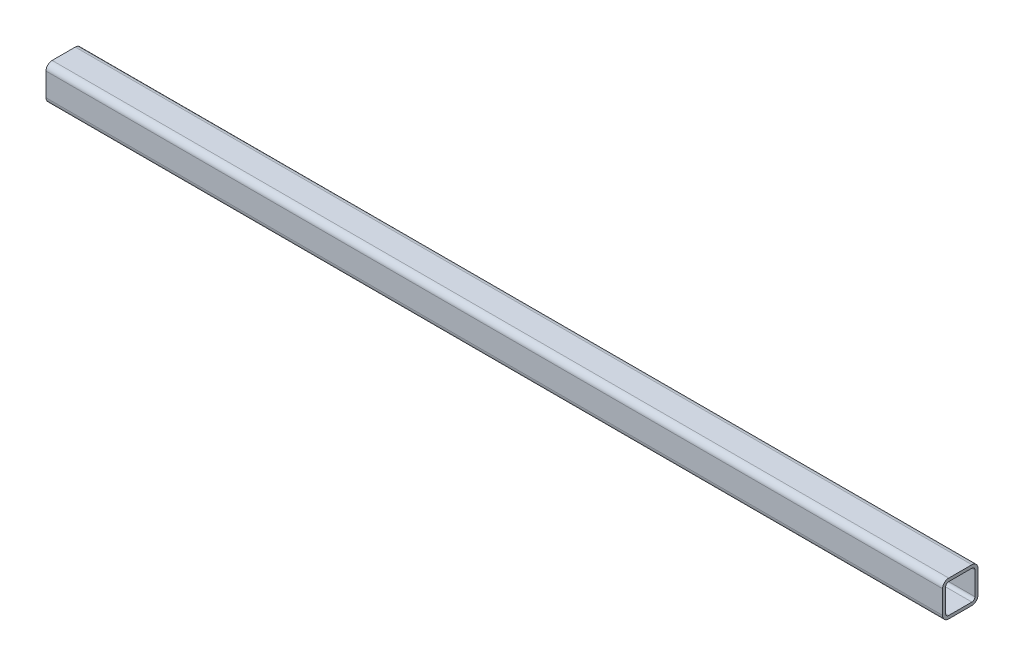
ISO-10303-21;
HEADER;
FILE_DESCRIPTION(('STEP AP214'),'2;1');
FILE_NAME('part.step','',(''),(''),'','','');
FILE_SCHEMA(('AUTOMOTIVE_DESIGN { 1 0 10303 214 1 1 1 1 }'));
ENDSEC;
DATA;
#1=APPLICATION_CONTEXT('core data for automotive mechanical design processes');
#2=APPLICATION_PROTOCOL_DEFINITION('international standard','automotive_design',2000,#1);
#3=PRODUCT_CONTEXT('',#1,'mechanical');
#4=PRODUCT('Part','Part','',(#3));
#5=PRODUCT_RELATED_PRODUCT_CATEGORY('part','',(#4));
#6=PRODUCT_DEFINITION_FORMATION('','',#4);
#7=PRODUCT_DEFINITION_CONTEXT('part definition',#1,'design');
#8=PRODUCT_DEFINITION('design','',#6,#7);
#9=PRODUCT_DEFINITION_SHAPE('','',#8);
#10=(LENGTH_UNIT() NAMED_UNIT(*) SI_UNIT(.MILLI.,.METRE.));
#11=(NAMED_UNIT(*) PLANE_ANGLE_UNIT() SI_UNIT($,.RADIAN.));
#12=(NAMED_UNIT(*) SI_UNIT($,.STERADIAN.) SOLID_ANGLE_UNIT());
#13=UNCERTAINTY_MEASURE_WITH_UNIT(LENGTH_MEASURE(1.E-05),#10,'distance_accuracy_value','');
#14=(GEOMETRIC_REPRESENTATION_CONTEXT(3) GLOBAL_UNCERTAINTY_ASSIGNED_CONTEXT((#13)) GLOBAL_UNIT_ASSIGNED_CONTEXT((#10,
#11,#12)) REPRESENTATION_CONTEXT('',''));
#15=CARTESIAN_POINT('',(0.,0.,0.));
#16=DIRECTION('',(0.,0.,1.));
#17=DIRECTION('',(1.,0.,0.));
#18=AXIS2_PLACEMENT_3D('',#15,#16,#17);
#19=CARTESIAN_POINT('',(380.,9.79999999999997,9.79999999999994));
#20=DIRECTION('',(-1.,0.,0.));
#21=DIRECTION('',(0.,0.,1.));
#22=AXIS2_PLACEMENT_3D('',#19,#20,#21);
#23=CYLINDRICAL_SURFACE('',#22,5.2);
#24=CARTESIAN_POINT('',(-380.,9.79999999999997,9.80000000000004));
#25=DIRECTION('',(1.,0.,0.));
#26=DIRECTION('',(0.,0.,-1.));
#27=AXIS2_PLACEMENT_3D('',#24,#25,#26);
#28=CIRCLE('',#27,5.2);
#29=CARTESIAN_POINT('',(-380.,15.,9.80000000000005));
#30=VERTEX_POINT('',#29);
#31=CARTESIAN_POINT('',(-380.,9.79999999999995,15.));
#32=VERTEX_POINT('',#31);
#33=EDGE_CURVE('E238',#30,#32,#28,.T.);
#34=ORIENTED_EDGE('',*,*,#33,.T.);
#35=DIRECTION('',(-1.,0.,0.));
#36=VECTOR('',#35,1.);
#37=CARTESIAN_POINT('',(380.,9.79999999999995,14.9999999999999));
#38=LINE('',#37,#36);
#39=CARTESIAN_POINT('',(380.,9.79999999999995,14.9999999999999));
#40=VERTEX_POINT('',#39);
#41=EDGE_CURVE('E12',#40,#32,#38,.T.);
#42=ORIENTED_EDGE('',*,*,#41,.F.);
#43=CARTESIAN_POINT('',(380.,9.79999999999997,9.79999999999994));
#44=DIRECTION('',(1.,0.,0.));
#45=DIRECTION('',(0.,0.,-1.));
#46=AXIS2_PLACEMENT_3D('',#43,#44,#45);
#47=CIRCLE('',#46,5.2);
#48=CARTESIAN_POINT('',(380.,15.,9.79999999999996));
#49=VERTEX_POINT('',#48);
#50=EDGE_CURVE('E316',#49,#40,#47,.T.);
#51=ORIENTED_EDGE('',*,*,#50,.F.);
#52=DIRECTION('',(-1.,0.,0.));
#53=VECTOR('',#52,1.);
#54=CARTESIAN_POINT('',(380.,15.,9.79999999999996));
#55=LINE('',#54,#53);
#56=EDGE_CURVE('E253',#49,#30,#55,.T.);
#57=ORIENTED_EDGE('',*,*,#56,.T.);
#58=EDGE_LOOP('',(#34,#42,#51,#57));
#59=FACE_BOUND('',#58,.T.);
#60=ADVANCED_FACE('F66',(#59),#23,.T.);
#61=CARTESIAN_POINT('',(380.,9.79999999999995,14.9999999999999));
#62=DIRECTION('',(0.,0.,-1.));
#63=DIRECTION('',(0.,1.,0.));
#64=AXIS2_PLACEMENT_3D('',#61,#62,#63);
#65=PLANE('',#64);
#66=DIRECTION('',(0.,-1.,0.));
#67=VECTOR('',#66,1.);
#68=CARTESIAN_POINT('',(-380.,9.79999999999995,15.));
#69=LINE('',#68,#67);
#70=CARTESIAN_POINT('',(-380.,-9.80000000000006,15.));
#71=VERTEX_POINT('',#70);
#72=EDGE_CURVE('E241',#32,#71,#69,.T.);
#73=ORIENTED_EDGE('',*,*,#72,.T.);
#74=DIRECTION('',(-1.,0.,0.));
#75=VECTOR('',#74,1.);
#76=CARTESIAN_POINT('',(380.,-9.80000000000006,14.9999999999999));
#77=LINE('',#76,#75);
#78=CARTESIAN_POINT('',(380.,-9.80000000000006,14.9999999999999));
#79=VERTEX_POINT('',#78);
#80=EDGE_CURVE('E76',#79,#71,#77,.T.);
#81=ORIENTED_EDGE('',*,*,#80,.F.);
#82=DIRECTION('',(0.,-1.,0.));
#83=VECTOR('',#82,1.);
#84=CARTESIAN_POINT('',(380.,9.79999999999995,14.9999999999999));
#85=LINE('',#84,#83);
#86=EDGE_CURVE('E318',#40,#79,#85,.T.);
#87=ORIENTED_EDGE('',*,*,#86,.F.);
#88=ORIENTED_EDGE('',*,*,#41,.T.);
#89=EDGE_LOOP('',(#73,#81,#87,#88));
#90=FACE_BOUND('',#89,.T.);
#91=ADVANCED_FACE('F353',(#90),#65,.F.);
#92=CARTESIAN_POINT('',(380.,-9.80000000000004,9.79999999999987));
#93=DIRECTION('',(-1.,0.,0.));
#94=DIRECTION('',(0.,0.,1.));
#95=AXIS2_PLACEMENT_3D('',#92,#93,#94);
#96=CYLINDRICAL_SURFACE('',#95,5.2);
#97=CARTESIAN_POINT('',(-380.,-9.80000000000004,9.79999999999997));
#98=DIRECTION('',(1.,0.,0.));
#99=DIRECTION('',(0.,0.,-1.));
#100=AXIS2_PLACEMENT_3D('',#97,#98,#99);
#101=CIRCLE('',#100,5.2);
#102=CARTESIAN_POINT('',(-380.,-15.,9.79999999999995));
#103=VERTEX_POINT('',#102);
#104=EDGE_CURVE('E243',#71,#103,#101,.T.);
#105=ORIENTED_EDGE('',*,*,#104,.T.);
#106=DIRECTION('',(-1.,0.,0.));
#107=VECTOR('',#106,1.);
#108=CARTESIAN_POINT('',(380.,-15.,9.79999999999985));
#109=LINE('',#108,#107);
#110=CARTESIAN_POINT('',(380.,-15.,9.79999999999985));
#111=VERTEX_POINT('',#110);
#112=EDGE_CURVE('E260',#111,#103,#109,.T.);
#113=ORIENTED_EDGE('',*,*,#112,.F.);
#114=CARTESIAN_POINT('',(380.,-9.80000000000004,9.79999999999987));
#115=DIRECTION('',(1.,0.,0.));
#116=DIRECTION('',(0.,0.,-1.));
#117=AXIS2_PLACEMENT_3D('',#114,#115,#116);
#118=CIRCLE('',#117,5.2);
#119=EDGE_CURVE('E320',#79,#111,#118,.T.);
#120=ORIENTED_EDGE('',*,*,#119,.F.);
#121=ORIENTED_EDGE('',*,*,#80,.T.);
#122=EDGE_LOOP('',(#105,#113,#120,#121));
#123=FACE_BOUND('',#122,.T.);
#124=ADVANCED_FACE('F358',(#123),#96,.T.);
#125=CARTESIAN_POINT('',(380.,-15.,-9.80000000000014));
#126=DIRECTION('',(0.,1.,0.));
#127=DIRECTION('',(0.,0.,1.));
#128=AXIS2_PLACEMENT_3D('',#125,#126,#127);
#129=PLANE('',#128);
#130=DIRECTION('',(0.,0.,-1.));
#131=VECTOR('',#130,1.);
#132=CARTESIAN_POINT('',(-380.,-15.,-9.80000000000005));
#133=LINE('',#132,#131);
#134=CARTESIAN_POINT('',(-380.,-15.,-9.80000000000005));
#135=VERTEX_POINT('',#134);
#136=EDGE_CURVE('E245',#103,#135,#133,.T.);
#137=ORIENTED_EDGE('',*,*,#136,.T.);
#138=DIRECTION('',(-1.,0.,0.));
#139=VECTOR('',#138,1.);
#140=CARTESIAN_POINT('',(380.,-15.,-9.80000000000014));
#141=LINE('',#140,#139);
#142=CARTESIAN_POINT('',(380.,-15.,-9.80000000000014));
#143=VERTEX_POINT('',#142);
#144=EDGE_CURVE('E257',#143,#135,#141,.T.);
#145=ORIENTED_EDGE('',*,*,#144,.F.);
#146=DIRECTION('',(0.,0.,-1.));
#147=VECTOR('',#146,1.);
#148=CARTESIAN_POINT('',(380.,-15.,-9.80000000000014));
#149=LINE('',#148,#147);
#150=EDGE_CURVE('E322',#111,#143,#149,.T.);
#151=ORIENTED_EDGE('',*,*,#150,.F.);
#152=ORIENTED_EDGE('',*,*,#112,.T.);
#153=EDGE_LOOP('',(#137,#145,#151,#152));
#154=FACE_BOUND('',#153,.T.);
#155=ADVANCED_FACE('F328',(#154),#129,.F.);
#156=CARTESIAN_POINT('',(380.,-9.79999999999997,-9.80000000000013));
#157=DIRECTION('',(-1.,0.,0.));
#158=DIRECTION('',(0.,0.,1.));
#159=AXIS2_PLACEMENT_3D('',#156,#157,#158);
#160=CYLINDRICAL_SURFACE('',#159,5.2);
#161=CARTESIAN_POINT('',(-380.,-9.79999999999997,-9.80000000000004));
#162=DIRECTION('',(1.,0.,0.));
#163=DIRECTION('',(0.,0.,-1.));
#164=AXIS2_PLACEMENT_3D('',#161,#162,#163);
#165=CIRCLE('',#164,5.2);
#166=CARTESIAN_POINT('',(-380.,-9.79999999999995,-15.));
#167=VERTEX_POINT('',#166);
#168=EDGE_CURVE('E247',#135,#167,#165,.T.);
#169=ORIENTED_EDGE('',*,*,#168,.T.);
#170=DIRECTION('',(-1.,0.,0.));
#171=VECTOR('',#170,1.);
#172=CARTESIAN_POINT('',(380.,-9.79999999999995,-15.0000000000001));
#173=LINE('',#172,#171);
#174=CARTESIAN_POINT('',(380.,-9.79999999999995,-15.0000000000001));
#175=VERTEX_POINT('',#174);
#176=EDGE_CURVE('E205',#175,#167,#173,.T.);
#177=ORIENTED_EDGE('',*,*,#176,.F.);
#178=CARTESIAN_POINT('',(380.,-9.79999999999997,-9.80000000000013));
#179=DIRECTION('',(1.,0.,0.));
#180=DIRECTION('',(0.,0.,-1.));
#181=AXIS2_PLACEMENT_3D('',#178,#179,#180);
#182=CIRCLE('',#181,5.2);
#183=EDGE_CURVE('E196',#143,#175,#182,.T.);
#184=ORIENTED_EDGE('',*,*,#183,.F.);
#185=ORIENTED_EDGE('',*,*,#144,.T.);
#186=EDGE_LOOP('',(#169,#177,#184,#185));
#187=FACE_BOUND('',#186,.T.);
#188=ADVANCED_FACE('F332',(#187),#160,.T.);
#189=CARTESIAN_POINT('',(380.,-9.79999999999995,-15.0000000000001));
#190=DIRECTION('',(0.,0.,1.));
#191=DIRECTION('',(0.,-1.,0.));
#192=AXIS2_PLACEMENT_3D('',#189,#190,#191);
#193=PLANE('',#192);
#194=DIRECTION('',(0.,1.,0.));
#195=VECTOR('',#194,1.);
#196=CARTESIAN_POINT('',(-380.,-9.79999999999995,-15.));
#197=LINE('',#196,#195);
#198=CARTESIAN_POINT('',(-380.,9.80000000000006,-15.));
#199=VERTEX_POINT('',#198);
#200=EDGE_CURVE('E204',#167,#199,#197,.T.);
#201=ORIENTED_EDGE('',*,*,#200,.T.);
#202=DIRECTION('',(-1.,0.,0.));
#203=VECTOR('',#202,1.);
#204=CARTESIAN_POINT('',(380.,9.80000000000006,-15.0000000000001));
#205=LINE('',#204,#203);
#206=CARTESIAN_POINT('',(380.,9.80000000000006,-15.0000000000001));
#207=VERTEX_POINT('',#206);
#208=EDGE_CURVE('E201',#207,#199,#205,.T.);
#209=ORIENTED_EDGE('',*,*,#208,.F.);
#210=DIRECTION('',(0.,1.,0.));
#211=VECTOR('',#210,1.);
#212=CARTESIAN_POINT('',(380.,-9.79999999999995,-15.0000000000001));
#213=LINE('',#212,#211);
#214=EDGE_CURVE('E190',#175,#207,#213,.T.);
#215=ORIENTED_EDGE('',*,*,#214,.F.);
#216=ORIENTED_EDGE('',*,*,#176,.T.);
#217=EDGE_LOOP('',(#201,#209,#215,#216));
#218=FACE_BOUND('',#217,.T.);
#219=ADVANCED_FACE('F202',(#218),#193,.F.);
#220=CARTESIAN_POINT('',(380.,9.80000000000004,-9.80000000000006));
#221=DIRECTION('',(-1.,0.,0.));
#222=DIRECTION('',(0.,0.,1.));
#223=AXIS2_PLACEMENT_3D('',#220,#221,#222);
#224=CYLINDRICAL_SURFACE('',#223,5.2);
#225=CARTESIAN_POINT('',(-380.,9.80000000000004,-9.79999999999997));
#226=DIRECTION('',(1.,0.,0.));
#227=DIRECTION('',(0.,0.,-1.));
#228=AXIS2_PLACEMENT_3D('',#225,#226,#227);
#229=CIRCLE('',#228,5.2);
#230=CARTESIAN_POINT('',(-380.,15.,-9.79999999999995));
#231=VERTEX_POINT('',#230);
#232=EDGE_CURVE('E138',#199,#231,#229,.T.);
#233=ORIENTED_EDGE('',*,*,#232,.T.);
#234=DIRECTION('',(-1.,0.,0.));
#235=VECTOR('',#234,1.);
#236=CARTESIAN_POINT('',(380.,15.,-9.80000000000004));
#237=LINE('',#236,#235);
#238=CARTESIAN_POINT('',(380.,15.,-9.80000000000004));
#239=VERTEX_POINT('',#238);
#240=EDGE_CURVE('E206',#239,#231,#237,.T.);
#241=ORIENTED_EDGE('',*,*,#240,.F.);
#242=CARTESIAN_POINT('',(380.,9.80000000000004,-9.80000000000006));
#243=DIRECTION('',(1.,0.,0.));
#244=DIRECTION('',(0.,0.,-1.));
#245=AXIS2_PLACEMENT_3D('',#242,#243,#244);
#246=CIRCLE('',#245,5.2);
#247=EDGE_CURVE('E194',#207,#239,#246,.T.);
#248=ORIENTED_EDGE('',*,*,#247,.F.);
#249=ORIENTED_EDGE('',*,*,#208,.T.);
#250=EDGE_LOOP('',(#233,#241,#248,#249));
#251=FACE_BOUND('',#250,.T.);
#252=ADVANCED_FACE('F208',(#251),#224,.T.);
#253=CARTESIAN_POINT('',(380.,-9.80000000000004,9.79999999999987));
#254=DIRECTION('',(-1.,0.,0.));
#255=DIRECTION('',(0.,0.,1.));
#256=AXIS2_PLACEMENT_3D('',#253,#254,#255);
#257=CYLINDRICAL_SURFACE('',#256,2.6);
#258=CARTESIAN_POINT('',(-380.,-9.80000000000004,9.79999999999997));
#259=DIRECTION('',(1.,0.,0.));
#260=DIRECTION('',(0.,0.,-1.));
#261=AXIS2_PLACEMENT_3D('',#258,#259,#260);
#262=CIRCLE('',#261,2.6);
#263=CARTESIAN_POINT('',(-380.,-9.80000000000005,12.4));
#264=VERTEX_POINT('',#263);
#265=CARTESIAN_POINT('',(-380.,-12.4,9.79999999999996));
#266=VERTEX_POINT('',#265);
#267=EDGE_CURVE('E214',#264,#266,#262,.T.);
#268=ORIENTED_EDGE('',*,*,#267,.F.);
#269=DIRECTION('',(-1.,0.,0.));
#270=VECTOR('',#269,1.);
#271=CARTESIAN_POINT('',(380.,-9.80000000000005,12.3999999999999));
#272=LINE('',#271,#270);
#273=CARTESIAN_POINT('',(380.,-9.80000000000005,12.3999999999999));
#274=VERTEX_POINT('',#273);
#275=EDGE_CURVE('E70',#274,#264,#272,.T.);
#276=ORIENTED_EDGE('',*,*,#275,.F.);
#277=CARTESIAN_POINT('',(380.,-9.80000000000004,9.79999999999987));
#278=DIRECTION('',(1.,0.,0.));
#279=DIRECTION('',(0.,0.,-1.));
#280=AXIS2_PLACEMENT_3D('',#277,#278,#279);
#281=CIRCLE('',#280,2.6);
#282=CARTESIAN_POINT('',(380.,-12.4,9.79999999999986));
#283=VERTEX_POINT('',#282);
#284=EDGE_CURVE('E252',#274,#283,#281,.T.);
#285=ORIENTED_EDGE('',*,*,#284,.T.);
#286=DIRECTION('',(-1.,0.,0.));
#287=VECTOR('',#286,1.);
#288=CARTESIAN_POINT('',(380.,-12.4,9.79999999999986));
#289=LINE('',#288,#287);
#290=EDGE_CURVE('E210',#283,#266,#289,.T.);
#291=ORIENTED_EDGE('',*,*,#290,.T.);
#292=EDGE_LOOP('',(#268,#276,#285,#291));
#293=FACE_BOUND('',#292,.T.);
#294=ADVANCED_FACE('F68',(#293),#257,.F.);
#295=CARTESIAN_POINT('',(380.,9.79999999999996,12.3999999999999));
#296=DIRECTION('',(0.,0.,-1.));
#297=DIRECTION('',(0.,1.,0.));
#298=AXIS2_PLACEMENT_3D('',#295,#296,#297);
#299=PLANE('',#298);
#300=DIRECTION('',(0.,-1.,0.));
#301=VECTOR('',#300,1.);
#302=CARTESIAN_POINT('',(-380.,9.79999999999996,12.4));
#303=LINE('',#302,#301);
#304=CARTESIAN_POINT('',(-380.,9.79999999999996,12.4));
#305=VERTEX_POINT('',#304);
#306=EDGE_CURVE('E217',#305,#264,#303,.T.);
#307=ORIENTED_EDGE('',*,*,#306,.F.);
#308=DIRECTION('',(-1.,0.,0.));
#309=VECTOR('',#308,1.);
#310=CARTESIAN_POINT('',(380.,9.79999999999996,12.3999999999999));
#311=LINE('',#310,#309);
#312=CARTESIAN_POINT('',(380.,9.79999999999996,12.3999999999999));
#313=VERTEX_POINT('',#312);
#314=EDGE_CURVE('E275',#313,#305,#311,.T.);
#315=ORIENTED_EDGE('',*,*,#314,.F.);
#316=DIRECTION('',(0.,-1.,0.));
#317=VECTOR('',#316,1.);
#318=CARTESIAN_POINT('',(380.,9.79999999999996,12.3999999999999));
#319=LINE('',#318,#317);
#320=EDGE_CURVE('E284',#313,#274,#319,.T.);
#321=ORIENTED_EDGE('',*,*,#320,.T.);
#322=ORIENTED_EDGE('',*,*,#275,.T.);
#323=EDGE_LOOP('',(#307,#315,#321,#322));
#324=FACE_BOUND('',#323,.T.);
#325=ADVANCED_FACE('F282',(#324),#299,.T.);
#326=CARTESIAN_POINT('',(380.,9.79999999999997,9.79999999999994));
#327=DIRECTION('',(-1.,0.,0.));
#328=DIRECTION('',(0.,0.,1.));
#329=AXIS2_PLACEMENT_3D('',#326,#327,#328);
#330=CYLINDRICAL_SURFACE('',#329,2.6);
#331=CARTESIAN_POINT('',(-380.,9.79999999999997,9.80000000000004));
#332=DIRECTION('',(1.,0.,0.));
#333=DIRECTION('',(0.,0.,-1.));
#334=AXIS2_PLACEMENT_3D('',#331,#332,#333);
#335=CIRCLE('',#334,2.6);
#336=CARTESIAN_POINT('',(-380.,12.4,9.80000000000005));
#337=VERTEX_POINT('',#336);
#338=EDGE_CURVE('E220',#337,#305,#335,.T.);
#339=ORIENTED_EDGE('',*,*,#338,.F.);
#340=DIRECTION('',(-1.,0.,0.));
#341=VECTOR('',#340,1.);
#342=CARTESIAN_POINT('',(380.,12.4,9.79999999999995));
#343=LINE('',#342,#341);
#344=CARTESIAN_POINT('',(380.,12.4,9.79999999999995));
#345=VERTEX_POINT('',#344);
#346=EDGE_CURVE('E274',#345,#337,#343,.T.);
#347=ORIENTED_EDGE('',*,*,#346,.F.);
#348=CARTESIAN_POINT('',(380.,9.79999999999997,9.79999999999994));
#349=DIRECTION('',(1.,0.,0.));
#350=DIRECTION('',(0.,0.,-1.));
#351=AXIS2_PLACEMENT_3D('',#348,#349,#350);
#352=CIRCLE('',#351,2.6);
#353=EDGE_CURVE('E292',#345,#313,#352,.T.);
#354=ORIENTED_EDGE('',*,*,#353,.T.);
#355=ORIENTED_EDGE('',*,*,#314,.T.);
#356=EDGE_LOOP('',(#339,#347,#354,#355));
#357=FACE_BOUND('',#356,.T.);
#358=ADVANCED_FACE('F290',(#357),#330,.F.);
#359=CARTESIAN_POINT('',(380.,12.4,9.79999999999995));
#360=DIRECTION('',(0.,-1.,0.));
#361=DIRECTION('',(0.,0.,-1.));
#362=AXIS2_PLACEMENT_3D('',#359,#360,#361);
#363=PLANE('',#362);
#364=DIRECTION('',(0.,0.,1.));
#365=VECTOR('',#364,1.);
#366=CARTESIAN_POINT('',(-380.,12.4,9.80000000000005));
#367=LINE('',#366,#365);
#368=CARTESIAN_POINT('',(-380.,12.4,-9.79999999999996));
#369=VERTEX_POINT('',#368);
#370=EDGE_CURVE('E223',#369,#337,#367,.T.);
#371=ORIENTED_EDGE('',*,*,#370,.F.);
#372=DIRECTION('',(-1.,0.,0.));
#373=VECTOR('',#372,1.);
#374=CARTESIAN_POINT('',(380.,12.4,-9.80000000000005));
#375=LINE('',#374,#373);
#376=CARTESIAN_POINT('',(380.,12.4,-9.80000000000005));
#377=VERTEX_POINT('',#376);
#378=EDGE_CURVE('E272',#377,#369,#375,.T.);
#379=ORIENTED_EDGE('',*,*,#378,.F.);
#380=DIRECTION('',(0.,0.,1.));
#381=VECTOR('',#380,1.);
#382=CARTESIAN_POINT('',(380.,12.4,9.79999999999995));
#383=LINE('',#382,#381);
#384=EDGE_CURVE('E298',#377,#345,#383,.T.);
#385=ORIENTED_EDGE('',*,*,#384,.T.);
#386=ORIENTED_EDGE('',*,*,#346,.T.);
#387=EDGE_LOOP('',(#371,#379,#385,#386));
#388=FACE_BOUND('',#387,.T.);
#389=ADVANCED_FACE('F301',(#388),#363,.T.);
#390=CARTESIAN_POINT('',(380.,9.80000000000004,-9.80000000000006));
#391=DIRECTION('',(-1.,0.,0.));
#392=DIRECTION('',(0.,0.,1.));
#393=AXIS2_PLACEMENT_3D('',#390,#391,#392);
#394=CYLINDRICAL_SURFACE('',#393,2.6);
#395=CARTESIAN_POINT('',(-380.,9.80000000000004,-9.79999999999997));
#396=DIRECTION('',(1.,0.,0.));
#397=DIRECTION('',(0.,0.,-1.));
#398=AXIS2_PLACEMENT_3D('',#395,#396,#397);
#399=CIRCLE('',#398,2.6);
#400=CARTESIAN_POINT('',(-380.,9.80000000000005,-12.4));
#401=VERTEX_POINT('',#400);
#402=EDGE_CURVE('E226',#401,#369,#399,.T.);
#403=ORIENTED_EDGE('',*,*,#402,.F.);
#404=DIRECTION('',(-1.,0.,0.));
#405=VECTOR('',#404,1.);
#406=CARTESIAN_POINT('',(380.,9.80000000000005,-12.4000000000001));
#407=LINE('',#406,#405);
#408=CARTESIAN_POINT('',(380.,9.80000000000005,-12.4000000000001));
#409=VERTEX_POINT('',#408);
#410=EDGE_CURVE('E270',#409,#401,#407,.T.);
#411=ORIENTED_EDGE('',*,*,#410,.F.);
#412=CARTESIAN_POINT('',(380.,9.80000000000004,-9.80000000000006));
#413=DIRECTION('',(1.,0.,0.));
#414=DIRECTION('',(0.,0.,-1.));
#415=AXIS2_PLACEMENT_3D('',#412,#413,#414);
#416=CIRCLE('',#415,2.6);
#417=EDGE_CURVE('E302',#409,#377,#416,.T.);
#418=ORIENTED_EDGE('',*,*,#417,.T.);
#419=ORIENTED_EDGE('',*,*,#378,.T.);
#420=EDGE_LOOP('',(#403,#411,#418,#419));
#421=FACE_BOUND('',#420,.T.);
#422=ADVANCED_FACE('F369',(#421),#394,.F.);
#423=CARTESIAN_POINT('',(380.,-9.79999999999996,-12.4000000000001));
#424=DIRECTION('',(0.,0.,1.));
#425=DIRECTION('',(0.,-1.,0.));
#426=AXIS2_PLACEMENT_3D('',#423,#424,#425);
#427=PLANE('',#426);
#428=DIRECTION('',(0.,1.,0.));
#429=VECTOR('',#428,1.);
#430=CARTESIAN_POINT('',(-380.,-9.79999999999996,-12.4));
#431=LINE('',#430,#429);
#432=CARTESIAN_POINT('',(-380.,-9.79999999999996,-12.4));
#433=VERTEX_POINT('',#432);
#434=EDGE_CURVE('E229',#433,#401,#431,.T.);
#435=ORIENTED_EDGE('',*,*,#434,.F.);
#436=DIRECTION('',(-1.,0.,0.));
#437=VECTOR('',#436,1.);
#438=CARTESIAN_POINT('',(380.,-9.79999999999996,-12.4000000000001));
#439=LINE('',#438,#437);
#440=CARTESIAN_POINT('',(380.,-9.79999999999996,-12.4000000000001));
#441=VERTEX_POINT('',#440);
#442=EDGE_CURVE('E268',#441,#433,#439,.T.);
#443=ORIENTED_EDGE('',*,*,#442,.F.);
#444=DIRECTION('',(0.,1.,0.));
#445=VECTOR('',#444,1.);
#446=CARTESIAN_POINT('',(380.,-9.79999999999996,-12.4000000000001));
#447=LINE('',#446,#445);
#448=EDGE_CURVE('E304',#441,#409,#447,.T.);
#449=ORIENTED_EDGE('',*,*,#448,.T.);
#450=ORIENTED_EDGE('',*,*,#410,.T.);
#451=EDGE_LOOP('',(#435,#443,#449,#450));
#452=FACE_BOUND('',#451,.T.);
#453=ADVANCED_FACE('F365',(#452),#427,.T.);
#454=CARTESIAN_POINT('',(380.,-9.79999999999997,-9.80000000000013));
#455=DIRECTION('',(-1.,0.,0.));
#456=DIRECTION('',(0.,0.,1.));
#457=AXIS2_PLACEMENT_3D('',#454,#455,#456);
#458=CYLINDRICAL_SURFACE('',#457,2.6);
#459=CARTESIAN_POINT('',(-380.,-9.79999999999997,-9.80000000000004));
#460=DIRECTION('',(1.,0.,0.));
#461=DIRECTION('',(0.,0.,-1.));
#462=AXIS2_PLACEMENT_3D('',#459,#460,#461);
#463=CIRCLE('',#462,2.6);
#464=CARTESIAN_POINT('',(-380.,-12.4,-9.80000000000005));
#465=VERTEX_POINT('',#464);
#466=EDGE_CURVE('E232',#465,#433,#463,.T.);
#467=ORIENTED_EDGE('',*,*,#466,.F.);
#468=DIRECTION('',(-1.,0.,0.));
#469=VECTOR('',#468,1.);
#470=CARTESIAN_POINT('',(380.,-12.4,-9.80000000000014));
#471=LINE('',#470,#469);
#472=CARTESIAN_POINT('',(380.,-12.4,-9.80000000000014));
#473=VERTEX_POINT('',#472);
#474=EDGE_CURVE('E266',#473,#465,#471,.T.);
#475=ORIENTED_EDGE('',*,*,#474,.F.);
#476=CARTESIAN_POINT('',(380.,-9.79999999999997,-9.80000000000013));
#477=DIRECTION('',(1.,0.,0.));
#478=DIRECTION('',(0.,0.,-1.));
#479=AXIS2_PLACEMENT_3D('',#476,#477,#478);
#480=CIRCLE('',#479,2.6);
#481=EDGE_CURVE('E310',#473,#441,#480,.T.);
#482=ORIENTED_EDGE('',*,*,#481,.T.);
#483=ORIENTED_EDGE('',*,*,#442,.T.);
#484=EDGE_LOOP('',(#467,#475,#482,#483));
#485=FACE_BOUND('',#484,.T.);
#486=ADVANCED_FACE('F347',(#485),#458,.F.);
#487=CARTESIAN_POINT('',(380.,-12.4,-9.80000000000014));
#488=DIRECTION('',(0.,1.,0.));
#489=DIRECTION('',(0.,0.,1.));
#490=AXIS2_PLACEMENT_3D('',#487,#488,#489);
#491=PLANE('',#490);
#492=DIRECTION('',(0.,0.,-1.));
#493=VECTOR('',#492,1.);
#494=CARTESIAN_POINT('',(-380.,-12.4,-9.80000000000005));
#495=LINE('',#494,#493);
#496=EDGE_CURVE('E235',#266,#465,#495,.T.);
#497=ORIENTED_EDGE('',*,*,#496,.F.);
#498=ORIENTED_EDGE('',*,*,#290,.F.);
#499=DIRECTION('',(0.,0.,-1.));
#500=VECTOR('',#499,1.);
#501=CARTESIAN_POINT('',(380.,-12.4,-9.80000000000014));
#502=LINE('',#501,#500);
#503=EDGE_CURVE('E313',#283,#473,#502,.T.);
#504=ORIENTED_EDGE('',*,*,#503,.T.);
#505=ORIENTED_EDGE('',*,*,#474,.T.);
#506=EDGE_LOOP('',(#497,#498,#504,#505));
#507=FACE_BOUND('',#506,.T.);
#508=ADVANCED_FACE('F340',(#507),#491,.T.);
#509=CARTESIAN_POINT('',(380.,15.,9.79999999999996));
#510=DIRECTION('',(0.,-1.,0.));
#511=DIRECTION('',(0.,0.,-1.));
#512=AXIS2_PLACEMENT_3D('',#509,#510,#511);
#513=PLANE('',#512);
#514=DIRECTION('',(0.,0.,1.));
#515=VECTOR('',#514,1.);
#516=CARTESIAN_POINT('',(-380.,15.,9.80000000000005));
#517=LINE('',#516,#515);
#518=EDGE_CURVE('E144',#231,#30,#517,.T.);
#519=ORIENTED_EDGE('',*,*,#518,.T.);
#520=ORIENTED_EDGE('',*,*,#56,.F.);
#521=DIRECTION('',(0.,0.,1.));
#522=VECTOR('',#521,1.);
#523=CARTESIAN_POINT('',(380.,15.,9.79999999999996));
#524=LINE('',#523,#522);
#525=EDGE_CURVE('E85',#239,#49,#524,.T.);
#526=ORIENTED_EDGE('',*,*,#525,.F.);
#527=ORIENTED_EDGE('',*,*,#240,.T.);
#528=EDGE_LOOP('',(#519,#520,#526,#527));
#529=FACE_BOUND('',#528,.T.);
#530=ADVANCED_FACE('F338',(#529),#513,.F.);
#531=CARTESIAN_POINT('',(380.,9.79999999999997,9.79999999999994));
#532=DIRECTION('',(1.,0.,0.));
#533=DIRECTION('',(0.,0.,-1.));
#534=AXIS2_PLACEMENT_3D('',#531,#532,#533);
#535=PLANE('',#534);
#536=ORIENTED_EDGE('',*,*,#284,.F.);
#537=ORIENTED_EDGE('',*,*,#320,.F.);
#538=ORIENTED_EDGE('',*,*,#353,.F.);
#539=ORIENTED_EDGE('',*,*,#384,.F.);
#540=ORIENTED_EDGE('',*,*,#417,.F.);
#541=ORIENTED_EDGE('',*,*,#448,.F.);
#542=ORIENTED_EDGE('',*,*,#481,.F.);
#543=ORIENTED_EDGE('',*,*,#503,.F.);
#544=EDGE_LOOP('',(#536,#537,#538,#539,#540,#541,#542,#543));
#545=FACE_BOUND('',#544,.T.);
#546=ORIENTED_EDGE('',*,*,#50,.T.);
#547=ORIENTED_EDGE('',*,*,#86,.T.);
#548=ORIENTED_EDGE('',*,*,#119,.T.);
#549=ORIENTED_EDGE('',*,*,#150,.T.);
#550=ORIENTED_EDGE('',*,*,#183,.T.);
#551=ORIENTED_EDGE('',*,*,#214,.T.);
#552=ORIENTED_EDGE('',*,*,#247,.T.);
#553=ORIENTED_EDGE('',*,*,#525,.T.);
#554=EDGE_LOOP('',(#546,#547,#548,#549,#550,#551,#552,#553));
#555=FACE_BOUND('',#554,.T.);
#556=ADVANCED_FACE('F192',(#545,#555),#535,.T.);
#557=CARTESIAN_POINT('',(-380.,9.79999999999997,9.80000000000004));
#558=DIRECTION('',(1.,0.,0.));
#559=DIRECTION('',(0.,0.,-1.));
#560=AXIS2_PLACEMENT_3D('',#557,#558,#559);
#561=PLANE('',#560);
#562=ORIENTED_EDGE('',*,*,#267,.T.);
#563=ORIENTED_EDGE('',*,*,#496,.T.);
#564=ORIENTED_EDGE('',*,*,#466,.T.);
#565=ORIENTED_EDGE('',*,*,#434,.T.);
#566=ORIENTED_EDGE('',*,*,#402,.T.);
#567=ORIENTED_EDGE('',*,*,#370,.T.);
#568=ORIENTED_EDGE('',*,*,#338,.T.);
#569=ORIENTED_EDGE('',*,*,#306,.T.);
#570=EDGE_LOOP('',(#562,#563,#564,#565,#566,#567,#568,#569));
#571=FACE_BOUND('',#570,.T.);
#572=ORIENTED_EDGE('',*,*,#33,.F.);
#573=ORIENTED_EDGE('',*,*,#518,.F.);
#574=ORIENTED_EDGE('',*,*,#232,.F.);
#575=ORIENTED_EDGE('',*,*,#200,.F.);
#576=ORIENTED_EDGE('',*,*,#168,.F.);
#577=ORIENTED_EDGE('',*,*,#136,.F.);
#578=ORIENTED_EDGE('',*,*,#104,.F.);
#579=ORIENTED_EDGE('',*,*,#72,.F.);
#580=EDGE_LOOP('',(#572,#573,#574,#575,#576,#577,#578,#579));
#581=FACE_BOUND('',#580,.T.);
#582=ADVANCED_FACE('F287',(#571,#581),#561,.F.);
#583=CLOSED_SHELL('',(#60,#91,#124,#155,#188,#219,#252,#294,#325,#358,#389,#422,#453,#486,#508,
#530,#556,#582));
#584=MANIFOLD_SOLID_BREP('B2',#583);
#585=ADVANCED_BREP_SHAPE_REPRESENTATION('',(#18,#584),#14);
#586=SHAPE_DEFINITION_REPRESENTATION(#9,#585);
ENDSEC;
END-ISO-10303-21;
